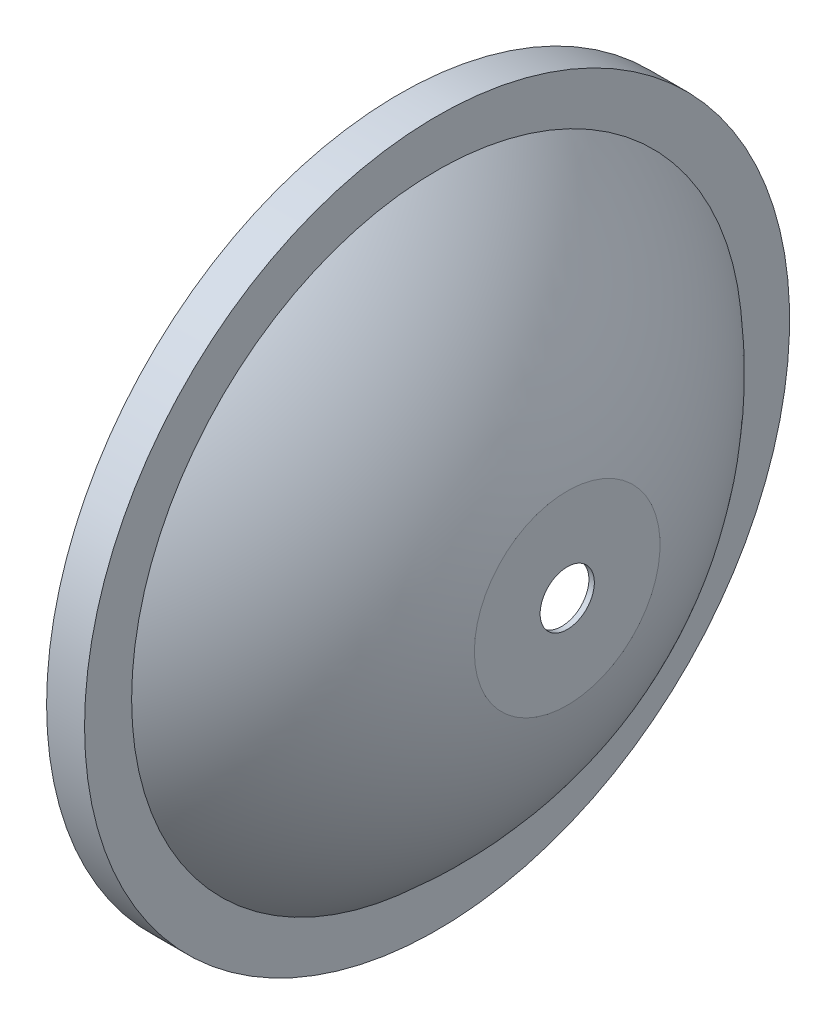
ISO-10303-21;
HEADER;
FILE_DESCRIPTION(('STEP AP214'),'2;1');
FILE_NAME('part.step','',(''),(''),'','','');
FILE_SCHEMA(('AUTOMOTIVE_DESIGN { 1 0 10303 214 1 1 1 1 }'));
ENDSEC;
DATA;
#1=APPLICATION_CONTEXT('core data for automotive mechanical design processes');
#2=APPLICATION_PROTOCOL_DEFINITION('international standard','automotive_design',2000,#1);
#3=PRODUCT_CONTEXT('',#1,'mechanical');
#4=PRODUCT('Part','Part','',(#3));
#5=PRODUCT_RELATED_PRODUCT_CATEGORY('part','',(#4));
#6=PRODUCT_DEFINITION_FORMATION('','',#4);
#7=PRODUCT_DEFINITION_CONTEXT('part definition',#1,'design');
#8=PRODUCT_DEFINITION('design','',#6,#7);
#9=PRODUCT_DEFINITION_SHAPE('','',#8);
#10=(LENGTH_UNIT() NAMED_UNIT(*) SI_UNIT(.MILLI.,.METRE.));
#11=(NAMED_UNIT(*) PLANE_ANGLE_UNIT() SI_UNIT($,.RADIAN.));
#12=(NAMED_UNIT(*) SI_UNIT($,.STERADIAN.) SOLID_ANGLE_UNIT());
#13=UNCERTAINTY_MEASURE_WITH_UNIT(LENGTH_MEASURE(1.E-05),#10,'distance_accuracy_value','');
#14=(GEOMETRIC_REPRESENTATION_CONTEXT(3) GLOBAL_UNCERTAINTY_ASSIGNED_CONTEXT((#13)) GLOBAL_UNIT_ASSIGNED_CONTEXT((#10,
#11,#12)) REPRESENTATION_CONTEXT('',''));
#15=CARTESIAN_POINT('',(0.,0.,0.));
#16=DIRECTION('',(0.,0.,1.));
#17=DIRECTION('',(1.,0.,0.));
#18=AXIS2_PLACEMENT_3D('',#15,#16,#17);
#19=CARTESIAN_POINT('',(-29.9929573971954,65.,0.));
#20=DIRECTION('',(1.,0.,0.));
#21=DIRECTION('',(0.,0.,-1.));
#22=AXIS2_PLACEMENT_3D('',#19,#20,#21);
#23=PLANE('',#22);
#24=CARTESIAN_POINT('',(-29.9929573971954,0.,0.));
#25=DIRECTION('',(-1.,0.,0.));
#26=DIRECTION('',(0.,0.,1.));
#27=AXIS2_PLACEMENT_3D('',#24,#25,#26);
#28=CIRCLE('',#27,64.);
#29=CARTESIAN_POINT('',(-29.9929573971954,0.,64.));
#30=VERTEX_POINT('',#29);
#31=EDGE_CURVE('E80',#30,#30,#28,.T.);
#32=ORIENTED_EDGE('',*,*,#31,.F.);
#33=EDGE_LOOP('',(#32));
#34=FACE_BOUND('',#33,.T.);
#35=CARTESIAN_POINT('',(-29.9929573971954,0.,0.));
#36=DIRECTION('',(-1.,0.,0.));
#37=DIRECTION('',(0.,0.,1.));
#38=AXIS2_PLACEMENT_3D('',#35,#36,#37);
#39=CIRCLE('',#38,65.);
#40=CARTESIAN_POINT('',(-29.9929573971954,0.,65.));
#41=VERTEX_POINT('',#40);
#42=EDGE_CURVE('E10',#41,#41,#39,.T.);
#43=ORIENTED_EDGE('',*,*,#42,.T.);
#44=EDGE_LOOP('',(#43));
#45=FACE_BOUND('',#44,.T.);
#46=ADVANCED_FACE('F37',(#34,#45),#23,.F.);
#47=CARTESIAN_POINT('',(-110.416386088107,0.,0.));
#48=DIRECTION('',(-1.,0.,0.));
#49=DIRECTION('',(0.,0.,1.));
#50=AXIS2_PLACEMENT_3D('',#47,#48,#49);
#51=CYLINDRICAL_SURFACE('',#50,65.);
#52=ORIENTED_EDGE('',*,*,#42,.F.);
#53=EDGE_LOOP('',(#52));
#54=FACE_BOUND('',#53,.T.);
#55=CARTESIAN_POINT('',(-22.9929573971954,0.,0.));
#56=DIRECTION('',(-1.,0.,0.));
#57=DIRECTION('',(0.,0.,1.));
#58=AXIS2_PLACEMENT_3D('',#55,#56,#57);
#59=CIRCLE('',#58,65.);
#60=CARTESIAN_POINT('',(-22.9929573971954,0.,65.));
#61=VERTEX_POINT('',#60);
#62=EDGE_CURVE('E44',#61,#61,#59,.T.);
#63=ORIENTED_EDGE('',*,*,#62,.T.);
#64=EDGE_LOOP('',(#63));
#65=FACE_BOUND('',#64,.T.);
#66=ADVANCED_FACE('F88',(#54,#65),#51,.T.);
#67=CARTESIAN_POINT('',(-22.9929573971954,65.,0.));
#68=DIRECTION('',(-1.,0.,0.));
#69=DIRECTION('',(0.,0.,1.));
#70=AXIS2_PLACEMENT_3D('',#67,#68,#69);
#71=PLANE('',#70);
#72=ORIENTED_EDGE('',*,*,#62,.F.);
#73=EDGE_LOOP('',(#72));
#74=FACE_BOUND('',#73,.T.);
#75=CARTESIAN_POINT('',(-22.9929573971954,0.,0.));
#76=DIRECTION('',(-1.,0.,0.));
#77=DIRECTION('',(0.,0.,1.));
#78=AXIS2_PLACEMENT_3D('',#75,#76,#77);
#79=CIRCLE('',#78,56.3205113613149);
#80=CARTESIAN_POINT('',(-22.9929573971954,0.,56.3205113613149));
#81=VERTEX_POINT('',#80);
#82=EDGE_CURVE('E49',#81,#81,#79,.T.);
#83=ORIENTED_EDGE('',*,*,#82,.T.);
#84=EDGE_LOOP('',(#83));
#85=FACE_BOUND('',#84,.T.);
#86=ADVANCED_FACE('F92',(#74,#85),#71,.F.);
#87=CARTESIAN_POINT('',(-70.9929573971954,0.,0.));
#88=DIRECTION('',(-1.,0.,0.));
#89=DIRECTION('',(0.,1.,0.));
#90=AXIS2_PLACEMENT_3D('',#87,#88,#89);
#91=SPHERICAL_SURFACE('',#90,74.);
#92=ORIENTED_EDGE('',*,*,#82,.F.);
#93=EDGE_LOOP('',(#92));
#94=FACE_BOUND('',#93,.T.);
#95=CARTESIAN_POINT('',(1.,0.,0.));
#96=DIRECTION('',(-1.,0.,0.));
#97=DIRECTION('',(0.,0.,1.));
#98=AXIS2_PLACEMENT_3D('',#95,#96,#97);
#99=CIRCLE('',#98,17.1176541969281);
#100=CARTESIAN_POINT('',(1.,0.,17.1176541969281));
#101=VERTEX_POINT('',#100);
#102=EDGE_CURVE('E54',#101,#101,#99,.T.);
#103=ORIENTED_EDGE('',*,*,#102,.T.);
#104=EDGE_LOOP('',(#103));
#105=FACE_BOUND('',#104,.T.);
#106=ADVANCED_FACE('F97',(#94,#105),#91,.T.);
#107=CARTESIAN_POINT('',(1.,5.,0.));
#108=DIRECTION('',(-1.,0.,0.));
#109=DIRECTION('',(0.,0.,1.));
#110=AXIS2_PLACEMENT_3D('',#107,#108,#109);
#111=PLANE('',#110);
#112=ORIENTED_EDGE('',*,*,#102,.F.);
#113=EDGE_LOOP('',(#112));
#114=FACE_BOUND('',#113,.T.);
#115=CARTESIAN_POINT('',(1.,0.,0.));
#116=DIRECTION('',(-1.,0.,0.));
#117=DIRECTION('',(0.,0.,1.));
#118=AXIS2_PLACEMENT_3D('',#115,#116,#117);
#119=CIRCLE('',#118,5.);
#120=CARTESIAN_POINT('',(1.,0.,5.));
#121=VERTEX_POINT('',#120);
#122=EDGE_CURVE('E60',#121,#121,#119,.T.);
#123=ORIENTED_EDGE('',*,*,#122,.T.);
#124=EDGE_LOOP('',(#123));
#125=FACE_BOUND('',#124,.T.);
#126=ADVANCED_FACE('F103',(#114,#125),#111,.F.);
#127=CARTESIAN_POINT('',(-110.416386088107,0.,0.));
#128=DIRECTION('',(-1.,0.,0.));
#129=DIRECTION('',(0.,0.,1.));
#130=AXIS2_PLACEMENT_3D('',#127,#128,#129);
#131=CYLINDRICAL_SURFACE('',#130,5.);
#132=ORIENTED_EDGE('',*,*,#122,.F.);
#133=EDGE_LOOP('',(#132));
#134=FACE_BOUND('',#133,.T.);
#135=CARTESIAN_POINT('',(0.,0.,0.));
#136=DIRECTION('',(-1.,0.,0.));
#137=DIRECTION('',(0.,0.,1.));
#138=AXIS2_PLACEMENT_3D('',#135,#136,#137);
#139=CIRCLE('',#138,5.);
#140=CARTESIAN_POINT('',(0.,0.,5.));
#141=VERTEX_POINT('',#140);
#142=EDGE_CURVE('E64',#141,#141,#139,.T.);
#143=ORIENTED_EDGE('',*,*,#142,.T.);
#144=EDGE_LOOP('',(#143));
#145=FACE_BOUND('',#144,.T.);
#146=ADVANCED_FACE('F107',(#134,#145),#131,.F.);
#147=CARTESIAN_POINT('',(0.,5.,0.));
#148=DIRECTION('',(1.,0.,0.));
#149=DIRECTION('',(0.,0.,-1.));
#150=AXIS2_PLACEMENT_3D('',#147,#148,#149);
#151=PLANE('',#150);
#152=ORIENTED_EDGE('',*,*,#142,.F.);
#153=EDGE_LOOP('',(#152));
#154=FACE_BOUND('',#153,.T.);
#155=CARTESIAN_POINT('',(0.,0.,0.));
#156=DIRECTION('',(-1.,0.,0.));
#157=DIRECTION('',(0.,0.,1.));
#158=AXIS2_PLACEMENT_3D('',#155,#156,#157);
#159=CIRCLE('',#158,17.);
#160=CARTESIAN_POINT('',(0.,0.,17.));
#161=VERTEX_POINT('',#160);
#162=EDGE_CURVE('E68',#161,#161,#159,.T.);
#163=ORIENTED_EDGE('',*,*,#162,.T.);
#164=EDGE_LOOP('',(#163));
#165=FACE_BOUND('',#164,.T.);
#166=ADVANCED_FACE('F111',(#154,#165),#151,.F.);
#167=CARTESIAN_POINT('',(-70.9929573971954,0.,0.));
#168=DIRECTION('',(-1.,0.,0.));
#169=DIRECTION('',(0.,1.,0.));
#170=AXIS2_PLACEMENT_3D('',#167,#168,#169);
#171=SPHERICAL_SURFACE('',#170,73.);
#172=ORIENTED_EDGE('',*,*,#162,.F.);
#173=EDGE_LOOP('',(#172));
#174=FACE_BOUND('',#173,.T.);
#175=CARTESIAN_POINT('',(-23.9929573971954,0.,0.));
#176=DIRECTION('',(-1.,0.,0.));
#177=DIRECTION('',(0.,0.,1.));
#178=AXIS2_PLACEMENT_3D('',#175,#176,#177);
#179=CIRCLE('',#178,55.8569601750758);
#180=CARTESIAN_POINT('',(-23.9929573971954,0.,55.8569601750758));
#181=VERTEX_POINT('',#180);
#182=EDGE_CURVE('E72',#181,#181,#179,.T.);
#183=ORIENTED_EDGE('',*,*,#182,.T.);
#184=EDGE_LOOP('',(#183));
#185=FACE_BOUND('',#184,.T.);
#186=ADVANCED_FACE('F115',(#174,#185),#171,.F.);
#187=CARTESIAN_POINT('',(-23.9929573971954,64.,0.));
#188=DIRECTION('',(1.,0.,0.));
#189=DIRECTION('',(0.,0.,-1.));
#190=AXIS2_PLACEMENT_3D('',#187,#188,#189);
#191=PLANE('',#190);
#192=ORIENTED_EDGE('',*,*,#182,.F.);
#193=EDGE_LOOP('',(#192));
#194=FACE_BOUND('',#193,.T.);
#195=CARTESIAN_POINT('',(-23.9929573971954,0.,0.));
#196=DIRECTION('',(-1.,0.,0.));
#197=DIRECTION('',(0.,0.,1.));
#198=AXIS2_PLACEMENT_3D('',#195,#196,#197);
#199=CIRCLE('',#198,64.);
#200=CARTESIAN_POINT('',(-23.9929573971954,0.,64.));
#201=VERTEX_POINT('',#200);
#202=EDGE_CURVE('E76',#201,#201,#199,.T.);
#203=ORIENTED_EDGE('',*,*,#202,.T.);
#204=EDGE_LOOP('',(#203));
#205=FACE_BOUND('',#204,.T.);
#206=ADVANCED_FACE('F119',(#194,#205),#191,.F.);
#207=CARTESIAN_POINT('',(-110.416386088107,0.,0.));
#208=DIRECTION('',(-1.,0.,0.));
#209=DIRECTION('',(0.,0.,1.));
#210=AXIS2_PLACEMENT_3D('',#207,#208,#209);
#211=CYLINDRICAL_SURFACE('',#210,64.);
#212=ORIENTED_EDGE('',*,*,#202,.F.);
#213=EDGE_LOOP('',(#212));
#214=FACE_BOUND('',#213,.T.);
#215=ORIENTED_EDGE('',*,*,#31,.T.);
#216=EDGE_LOOP('',(#215));
#217=FACE_BOUND('',#216,.T.);
#218=ADVANCED_FACE('F85',(#214,#217),#211,.F.);
#219=CLOSED_SHELL('',(#46,#66,#86,#106,#126,#146,#166,#186,#206,#218));
#220=MANIFOLD_SOLID_BREP('B2',#219);
#221=ADVANCED_BREP_SHAPE_REPRESENTATION('',(#18,#220),#14);
#222=SHAPE_DEFINITION_REPRESENTATION(#9,#221);
ENDSEC;
END-ISO-10303-21;
